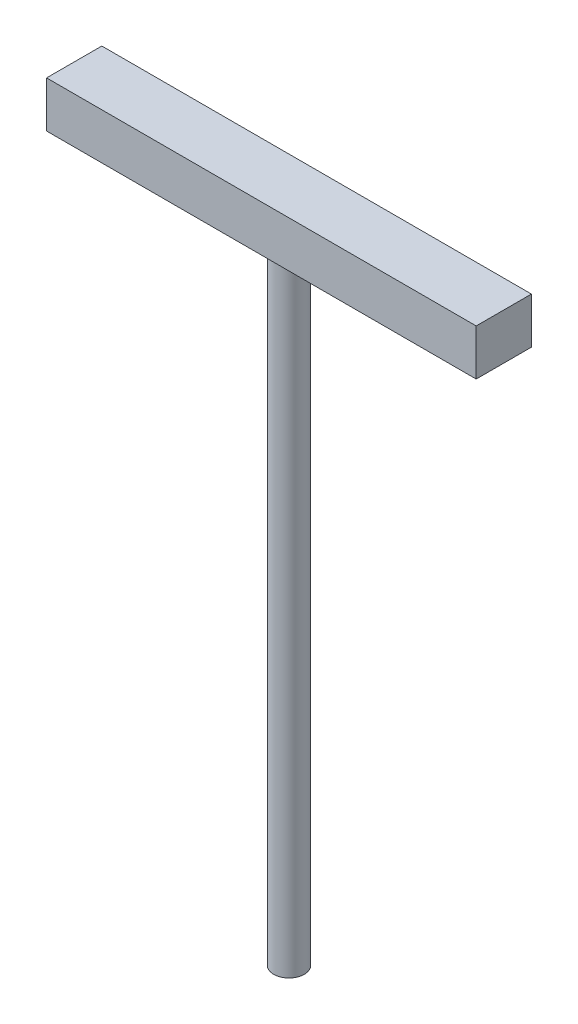
ISO-10303-21;
HEADER;
FILE_DESCRIPTION(('STEP AP214'),'2;1');
FILE_NAME('part.step','',(''),(''),'','','');
FILE_SCHEMA(('AUTOMOTIVE_DESIGN { 1 0 10303 214 1 1 1 1 }'));
ENDSEC;
DATA;
#1=APPLICATION_CONTEXT('core data for automotive mechanical design processes');
#2=APPLICATION_PROTOCOL_DEFINITION('international standard','automotive_design',2000,#1);
#3=PRODUCT_CONTEXT('',#1,'mechanical');
#4=PRODUCT('Part','Part','',(#3));
#5=PRODUCT_RELATED_PRODUCT_CATEGORY('part','',(#4));
#6=PRODUCT_DEFINITION_FORMATION('','',#4);
#7=PRODUCT_DEFINITION_CONTEXT('part definition',#1,'design');
#8=PRODUCT_DEFINITION('design','',#6,#7);
#9=PRODUCT_DEFINITION_SHAPE('','',#8);
#10=(LENGTH_UNIT() NAMED_UNIT(*) SI_UNIT(.MILLI.,.METRE.));
#11=(NAMED_UNIT(*) PLANE_ANGLE_UNIT() SI_UNIT($,.RADIAN.));
#12=(NAMED_UNIT(*) SI_UNIT($,.STERADIAN.) SOLID_ANGLE_UNIT());
#13=UNCERTAINTY_MEASURE_WITH_UNIT(LENGTH_MEASURE(1.E-05),#10,'distance_accuracy_value','');
#14=(GEOMETRIC_REPRESENTATION_CONTEXT(3) GLOBAL_UNCERTAINTY_ASSIGNED_CONTEXT((#13)) GLOBAL_UNIT_ASSIGNED_CONTEXT((#10,
#11,#12)) REPRESENTATION_CONTEXT('',''));
#15=CARTESIAN_POINT('',(0.,0.,0.));
#16=DIRECTION('',(0.,0.,1.));
#17=DIRECTION('',(1.,0.,0.));
#18=AXIS2_PLACEMENT_3D('',#15,#16,#17);
#19=CARTESIAN_POINT('',(88.9,4.7625,5.715));
#20=DIRECTION('',(0.,0.,-1.));
#21=DIRECTION('',(0.,1.,0.));
#22=AXIS2_PLACEMENT_3D('',#19,#20,#21);
#23=PLANE('',#22);
#24=DIRECTION('',(0.,-1.,0.));
#25=VECTOR('',#24,1.);
#26=CARTESIAN_POINT('',(0.,4.7625,5.715));
#27=LINE('',#26,#25);
#28=CARTESIAN_POINT('',(0.,4.7625,5.715));
#29=VERTEX_POINT('',#28);
#30=CARTESIAN_POINT('',(0.,-4.7625,5.715));
#31=VERTEX_POINT('',#30);
#32=EDGE_CURVE('E98',#29,#31,#27,.T.);
#33=ORIENTED_EDGE('',*,*,#32,.T.);
#34=DIRECTION('',(-1.,0.,0.));
#35=VECTOR('',#34,1.);
#36=CARTESIAN_POINT('',(88.9,-4.7625,5.715));
#37=LINE('',#36,#35);
#38=CARTESIAN_POINT('',(88.9,-4.7625,5.715));
#39=VERTEX_POINT('',#38);
#40=EDGE_CURVE('E40',#39,#31,#37,.T.);
#41=ORIENTED_EDGE('',*,*,#40,.F.);
#42=DIRECTION('',(0.,-1.,0.));
#43=VECTOR('',#42,1.);
#44=CARTESIAN_POINT('',(88.9,4.7625,5.715));
#45=LINE('',#44,#43);
#46=CARTESIAN_POINT('',(88.9,4.7625,5.715));
#47=VERTEX_POINT('',#46);
#48=EDGE_CURVE('E84',#47,#39,#45,.T.);
#49=ORIENTED_EDGE('',*,*,#48,.F.);
#50=DIRECTION('',(-1.,0.,0.));
#51=VECTOR('',#50,1.);
#52=CARTESIAN_POINT('',(88.9,4.7625,5.715));
#53=LINE('',#52,#51);
#54=EDGE_CURVE('E94',#47,#29,#53,.T.);
#55=ORIENTED_EDGE('',*,*,#54,.T.);
#56=EDGE_LOOP('',(#33,#41,#49,#55));
#57=FACE_BOUND('',#56,.T.);
#58=ADVANCED_FACE('F32',(#57),#23,.F.);
#59=CARTESIAN_POINT('',(88.9,-4.7625,-5.715));
#60=DIRECTION('',(0.,1.,0.));
#61=DIRECTION('',(0.,0.,1.));
#62=AXIS2_PLACEMENT_3D('',#59,#60,#61);
#63=PLANE('',#62);
#64=CARTESIAN_POINT('',(44.45,-4.7625,0.));
#65=DIRECTION('',(0.,1.,0.));
#66=DIRECTION('',(0.,0.,1.));
#67=AXIS2_PLACEMENT_3D('',#64,#65,#66);
#68=CIRCLE('',#67,3.175);
#69=CARTESIAN_POINT('',(44.45,-4.7625,3.175));
#70=VERTEX_POINT('',#69);
#71=EDGE_CURVE('E11',#70,#70,#68,.F.);
#72=ORIENTED_EDGE('',*,*,#71,.F.);
#73=EDGE_LOOP('',(#72));
#74=FACE_BOUND('',#73,.T.);
#75=DIRECTION('',(0.,0.,-1.));
#76=VECTOR('',#75,1.);
#77=CARTESIAN_POINT('',(0.,-4.7625,-5.715));
#78=LINE('',#77,#76);
#79=CARTESIAN_POINT('',(0.,-4.7625,-5.715));
#80=VERTEX_POINT('',#79);
#81=EDGE_CURVE('E89',#31,#80,#78,.T.);
#82=ORIENTED_EDGE('',*,*,#81,.T.);
#83=DIRECTION('',(-1.,0.,0.));
#84=VECTOR('',#83,1.);
#85=CARTESIAN_POINT('',(88.9,-4.7625,-5.715));
#86=LINE('',#85,#84);
#87=CARTESIAN_POINT('',(88.9,-4.7625,-5.715));
#88=VERTEX_POINT('',#87);
#89=EDGE_CURVE('E87',#88,#80,#86,.T.);
#90=ORIENTED_EDGE('',*,*,#89,.F.);
#91=DIRECTION('',(0.,0.,-1.));
#92=VECTOR('',#91,1.);
#93=CARTESIAN_POINT('',(88.9,-4.7625,-5.715));
#94=LINE('',#93,#92);
#95=EDGE_CURVE('E79',#39,#88,#94,.T.);
#96=ORIENTED_EDGE('',*,*,#95,.F.);
#97=ORIENTED_EDGE('',*,*,#40,.T.);
#98=EDGE_LOOP('',(#82,#90,#96,#97));
#99=FACE_BOUND('',#98,.T.);
#100=ADVANCED_FACE('F88',(#74,#99),#63,.F.);
#101=CARTESIAN_POINT('',(88.9,4.7625,-5.715));
#102=DIRECTION('',(0.,0.,1.));
#103=DIRECTION('',(0.,-1.,0.));
#104=AXIS2_PLACEMENT_3D('',#101,#102,#103);
#105=PLANE('',#104);
#106=DIRECTION('',(0.,1.,0.));
#107=VECTOR('',#106,1.);
#108=CARTESIAN_POINT('',(0.,4.7625,-5.715));
#109=LINE('',#108,#107);
#110=CARTESIAN_POINT('',(0.,4.7625,-5.715));
#111=VERTEX_POINT('',#110);
#112=EDGE_CURVE('E65',#80,#111,#109,.T.);
#113=ORIENTED_EDGE('',*,*,#112,.T.);
#114=DIRECTION('',(-1.,0.,0.));
#115=VECTOR('',#114,1.);
#116=CARTESIAN_POINT('',(88.9,4.7625,-5.715));
#117=LINE('',#116,#115);
#118=CARTESIAN_POINT('',(88.9,4.7625,-5.715));
#119=VERTEX_POINT('',#118);
#120=EDGE_CURVE('E90',#119,#111,#117,.T.);
#121=ORIENTED_EDGE('',*,*,#120,.F.);
#122=DIRECTION('',(0.,1.,0.));
#123=VECTOR('',#122,1.);
#124=CARTESIAN_POINT('',(88.9,4.7625,-5.715));
#125=LINE('',#124,#123);
#126=EDGE_CURVE('E82',#88,#119,#125,.T.);
#127=ORIENTED_EDGE('',*,*,#126,.F.);
#128=ORIENTED_EDGE('',*,*,#89,.T.);
#129=EDGE_LOOP('',(#113,#121,#127,#128));
#130=FACE_BOUND('',#129,.T.);
#131=ADVANCED_FACE('F92',(#130),#105,.F.);
#132=CARTESIAN_POINT('',(88.9,4.7625,-5.715));
#133=DIRECTION('',(0.,-1.,0.));
#134=DIRECTION('',(0.,0.,-1.));
#135=AXIS2_PLACEMENT_3D('',#132,#133,#134);
#136=PLANE('',#135);
#137=DIRECTION('',(0.,0.,1.));
#138=VECTOR('',#137,1.);
#139=CARTESIAN_POINT('',(0.,4.7625,-5.715));
#140=LINE('',#139,#138);
#141=EDGE_CURVE('E71',#111,#29,#140,.T.);
#142=ORIENTED_EDGE('',*,*,#141,.T.);
#143=ORIENTED_EDGE('',*,*,#54,.F.);
#144=DIRECTION('',(0.,0.,1.));
#145=VECTOR('',#144,1.);
#146=CARTESIAN_POINT('',(88.9,4.7625,-5.715));
#147=LINE('',#146,#145);
#148=EDGE_CURVE('E48',#119,#47,#147,.T.);
#149=ORIENTED_EDGE('',*,*,#148,.F.);
#150=ORIENTED_EDGE('',*,*,#120,.T.);
#151=EDGE_LOOP('',(#142,#143,#149,#150));
#152=FACE_BOUND('',#151,.T.);
#153=ADVANCED_FACE('F120',(#152),#136,.F.);
#154=CARTESIAN_POINT('',(88.9,0.,0.));
#155=DIRECTION('',(-1.,0.,0.));
#156=DIRECTION('',(0.,0.,1.));
#157=AXIS2_PLACEMENT_3D('',#154,#155,#156);
#158=PLANE('',#157);
#159=ORIENTED_EDGE('',*,*,#48,.T.);
#160=ORIENTED_EDGE('',*,*,#95,.T.);
#161=ORIENTED_EDGE('',*,*,#126,.T.);
#162=ORIENTED_EDGE('',*,*,#148,.T.);
#163=EDGE_LOOP('',(#159,#160,#161,#162));
#164=FACE_BOUND('',#163,.T.);
#165=ADVANCED_FACE('F80',(#164),#158,.F.);
#166=CARTESIAN_POINT('',(0.,0.,0.));
#167=DIRECTION('',(-1.,0.,0.));
#168=DIRECTION('',(0.,0.,1.));
#169=AXIS2_PLACEMENT_3D('',#166,#167,#168);
#170=PLANE('',#169);
#171=ORIENTED_EDGE('',*,*,#32,.F.);
#172=ORIENTED_EDGE('',*,*,#141,.F.);
#173=ORIENTED_EDGE('',*,*,#112,.F.);
#174=ORIENTED_EDGE('',*,*,#81,.F.);
#175=EDGE_LOOP('',(#171,#172,#173,#174));
#176=FACE_BOUND('',#175,.T.);
#177=ADVANCED_FACE('F109',(#176),#170,.T.);
#178=CARTESIAN_POINT('',(44.45,-134.9375,0.));
#179=DIRECTION('',(0.,1.,0.));
#180=DIRECTION('',(0.,0.,1.));
#181=AXIS2_PLACEMENT_3D('',#178,#179,#180);
#182=CYLINDRICAL_SURFACE('',#181,3.175);
#183=CARTESIAN_POINT('',(44.45,-134.9375,0.));
#184=DIRECTION('',(0.,-1.,0.));
#185=DIRECTION('',(0.,0.,-1.));
#186=AXIS2_PLACEMENT_3D('',#183,#184,#185);
#187=CIRCLE('',#186,3.175);
#188=CARTESIAN_POINT('',(44.45,-134.9375,-3.17500000000002));
#189=VERTEX_POINT('',#188);
#190=EDGE_CURVE('E101',#189,#189,#187,.T.);
#191=ORIENTED_EDGE('',*,*,#190,.F.);
#192=EDGE_LOOP('',(#191));
#193=FACE_BOUND('',#192,.T.);
#194=ORIENTED_EDGE('',*,*,#71,.T.);
#195=EDGE_LOOP('',(#194));
#196=FACE_BOUND('',#195,.T.);
#197=ADVANCED_FACE('F111',(#193,#196),#182,.T.);
#198=CARTESIAN_POINT('',(44.45,-134.9375,0.));
#199=DIRECTION('',(0.,-1.,0.));
#200=DIRECTION('',(0.,0.,-1.));
#201=AXIS2_PLACEMENT_3D('',#198,#199,#200);
#202=PLANE('',#201);
#203=ORIENTED_EDGE('',*,*,#190,.T.);
#204=EDGE_LOOP('',(#203));
#205=FACE_BOUND('',#204,.T.);
#206=ADVANCED_FACE('F117',(#205),#202,.T.);
#207=CLOSED_SHELL('',(#58,#100,#131,#153,#165,#177,#197,#206));
#208=MANIFOLD_SOLID_BREP('B2',#207);
#209=ADVANCED_BREP_SHAPE_REPRESENTATION('',(#18,#208),#14);
#210=SHAPE_DEFINITION_REPRESENTATION(#9,#209);
ENDSEC;
END-ISO-10303-21;
